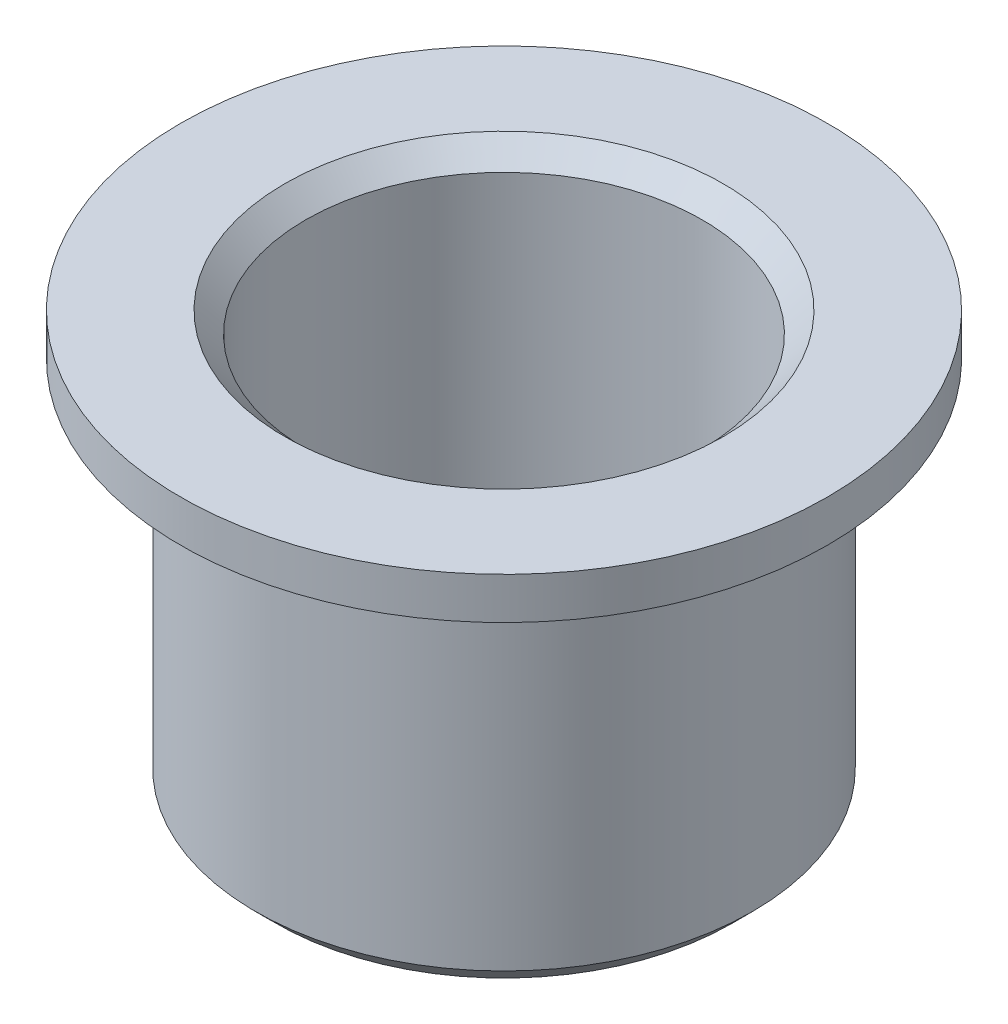
ISO-10303-21;
HEADER;
FILE_DESCRIPTION(('STEP AP214'),'2;1');
FILE_NAME('part.step','',(''),(''),'','','');
FILE_SCHEMA(('AUTOMOTIVE_DESIGN { 1 0 10303 214 1 1 1 1 }'));
ENDSEC;
DATA;
#1=APPLICATION_CONTEXT('core data for automotive mechanical design processes');
#2=APPLICATION_PROTOCOL_DEFINITION('international standard','automotive_design',2000,#1);
#3=PRODUCT_CONTEXT('',#1,'mechanical');
#4=PRODUCT('Part','Part','',(#3));
#5=PRODUCT_RELATED_PRODUCT_CATEGORY('part','',(#4));
#6=PRODUCT_DEFINITION_FORMATION('','',#4);
#7=PRODUCT_DEFINITION_CONTEXT('part definition',#1,'design');
#8=PRODUCT_DEFINITION('design','',#6,#7);
#9=PRODUCT_DEFINITION_SHAPE('','',#8);
#10=(LENGTH_UNIT() NAMED_UNIT(*) SI_UNIT(.MILLI.,.METRE.));
#11=(NAMED_UNIT(*) PLANE_ANGLE_UNIT() SI_UNIT($,.RADIAN.));
#12=(NAMED_UNIT(*) SI_UNIT($,.STERADIAN.) SOLID_ANGLE_UNIT());
#13=UNCERTAINTY_MEASURE_WITH_UNIT(LENGTH_MEASURE(1.E-05),#10,'distance_accuracy_value','');
#14=(GEOMETRIC_REPRESENTATION_CONTEXT(3) GLOBAL_UNCERTAINTY_ASSIGNED_CONTEXT((#13)) GLOBAL_UNIT_ASSIGNED_CONTEXT((#10,
#11,#12)) REPRESENTATION_CONTEXT('',''));
#15=CARTESIAN_POINT('',(0.,0.,0.));
#16=DIRECTION('',(0.,0.,1.));
#17=DIRECTION('',(1.,0.,0.));
#18=AXIS2_PLACEMENT_3D('',#15,#16,#17);
#19=CARTESIAN_POINT('',(0.,-12.923275862069,0.));
#20=DIRECTION('',(0.,-1.,0.));
#21=DIRECTION('',(1.,0.,0.));
#22=AXIS2_PLACEMENT_3D('',#19,#20,#21);
#23=CYLINDRICAL_SURFACE('',#22,5.95000000000001);
#24=CARTESIAN_POINT('',(0.,7.96076951545869,0.));
#25=DIRECTION('',(0.,-1.,0.));
#26=DIRECTION('',(1.,0.,0.));
#27=AXIS2_PLACEMENT_3D('',#24,#25,#26);
#28=CIRCLE('',#27,5.95000000000001);
#29=CARTESIAN_POINT('',(5.95000000000001,7.96076951545869,0.));
#30=VERTEX_POINT('',#29);
#31=EDGE_CURVE('E59',#30,#30,#28,.T.);
#32=ORIENTED_EDGE('',*,*,#31,.T.);
#33=EDGE_LOOP('',(#32));
#34=FACE_BOUND('',#33,.T.);
#35=CARTESIAN_POINT('',(0.,0.499999999999999,0.));
#36=DIRECTION('',(0.,-1.,0.));
#37=DIRECTION('',(1.,0.,0.));
#38=AXIS2_PLACEMENT_3D('',#35,#36,#37);
#39=CIRCLE('',#38,5.95000000000001);
#40=CARTESIAN_POINT('',(5.95,0.5,0.));
#41=VERTEX_POINT('',#40);
#42=EDGE_CURVE('E10',#41,#41,#39,.T.);
#43=ORIENTED_EDGE('',*,*,#42,.F.);
#44=EDGE_LOOP('',(#43));
#45=FACE_BOUND('',#44,.T.);
#46=ADVANCED_FACE('F31',(#34,#45),#23,.T.);
#47=CARTESIAN_POINT('',(0.,0.,0.));
#48=DIRECTION('',(0.,1.,0.));
#49=DIRECTION('',(-1.,0.,0.));
#50=AXIS2_PLACEMENT_3D('',#47,#48,#49);
#51=CONICAL_SURFACE('',#50,5.45000000000001,0.785398163397447);
#52=ORIENTED_EDGE('',*,*,#42,.T.);
#53=EDGE_LOOP('',(#52));
#54=FACE_BOUND('',#53,.T.);
#55=CARTESIAN_POINT('',(0.,0.,0.));
#56=DIRECTION('',(0.,-1.,0.));
#57=DIRECTION('',(1.,0.,0.));
#58=AXIS2_PLACEMENT_3D('',#55,#56,#57);
#59=CIRCLE('',#58,5.45000000000001);
#60=CARTESIAN_POINT('',(5.45,0.,0.));
#61=VERTEX_POINT('',#60);
#62=EDGE_CURVE('E37',#61,#61,#59,.T.);
#63=ORIENTED_EDGE('',*,*,#62,.F.);
#64=EDGE_LOOP('',(#63));
#65=FACE_BOUND('',#64,.T.);
#66=ADVANCED_FACE('F77',(#54,#65),#51,.T.);
#67=CARTESIAN_POINT('',(5.45,0.,0.));
#68=DIRECTION('',(0.,-1.,0.));
#69=DIRECTION('',(1.,0.,0.));
#70=AXIS2_PLACEMENT_3D('',#67,#68,#69);
#71=PLANE('',#70);
#72=ORIENTED_EDGE('',*,*,#62,.T.);
#73=EDGE_LOOP('',(#72));
#74=FACE_BOUND('',#73,.T.);
#75=CARTESIAN_POINT('',(0.,0.,0.));
#76=DIRECTION('',(0.,-1.,0.));
#77=DIRECTION('',(1.,0.,0.));
#78=AXIS2_PLACEMENT_3D('',#75,#76,#77);
#79=CIRCLE('',#78,4.75);
#80=CARTESIAN_POINT('',(4.75,0.,0.));
#81=VERTEX_POINT('',#80);
#82=EDGE_CURVE('E41',#81,#81,#79,.T.);
#83=ORIENTED_EDGE('',*,*,#82,.F.);
#84=EDGE_LOOP('',(#83));
#85=FACE_BOUND('',#84,.T.);
#86=ADVANCED_FACE('F81',(#74,#85),#71,.T.);
#87=CARTESIAN_POINT('',(0.,-12.923275862069,0.));
#88=DIRECTION('',(0.,-1.,0.));
#89=DIRECTION('',(1.,0.,0.));
#90=AXIS2_PLACEMENT_3D('',#87,#88,#89);
#91=CYLINDRICAL_SURFACE('',#90,4.75);
#92=ORIENTED_EDGE('',*,*,#82,.T.);
#93=EDGE_LOOP('',(#92));
#94=FACE_BOUND('',#93,.T.);
#95=CARTESIAN_POINT('',(0.,9.5,0.));
#96=DIRECTION('',(0.,-1.,0.));
#97=DIRECTION('',(1.,0.,0.));
#98=AXIS2_PLACEMENT_3D('',#95,#96,#97);
#99=CIRCLE('',#98,4.75);
#100=CARTESIAN_POINT('',(4.75,9.5,0.));
#101=VERTEX_POINT('',#100);
#102=EDGE_CURVE('E45',#101,#101,#99,.T.);
#103=ORIENTED_EDGE('',*,*,#102,.F.);
#104=EDGE_LOOP('',(#103));
#105=FACE_BOUND('',#104,.T.);
#106=ADVANCED_FACE('F85',(#94,#105),#91,.F.);
#107=CARTESIAN_POINT('',(0.,10.,0.));
#108=DIRECTION('',(0.,1.,0.));
#109=DIRECTION('',(-1.,0.,0.));
#110=AXIS2_PLACEMENT_3D('',#107,#108,#109);
#111=CONICAL_SURFACE('',#110,5.25,0.785398163397447);
#112=ORIENTED_EDGE('',*,*,#102,.T.);
#113=EDGE_LOOP('',(#112));
#114=FACE_BOUND('',#113,.T.);
#115=CARTESIAN_POINT('',(0.,10.,0.));
#116=DIRECTION('',(0.,-1.,0.));
#117=DIRECTION('',(1.,0.,0.));
#118=AXIS2_PLACEMENT_3D('',#115,#116,#117);
#119=CIRCLE('',#118,5.25);
#120=CARTESIAN_POINT('',(5.25,10.,0.));
#121=VERTEX_POINT('',#120);
#122=EDGE_CURVE('E50',#121,#121,#119,.T.);
#123=ORIENTED_EDGE('',*,*,#122,.F.);
#124=EDGE_LOOP('',(#123));
#125=FACE_BOUND('',#124,.T.);
#126=ADVANCED_FACE('F91',(#114,#125),#111,.F.);
#127=CARTESIAN_POINT('',(5.25,10.,0.));
#128=DIRECTION('',(0.,1.,0.));
#129=DIRECTION('',(-1.,0.,0.));
#130=AXIS2_PLACEMENT_3D('',#127,#128,#129);
#131=PLANE('',#130);
#132=ORIENTED_EDGE('',*,*,#122,.T.);
#133=EDGE_LOOP('',(#132));
#134=FACE_BOUND('',#133,.T.);
#135=CARTESIAN_POINT('',(0.,10.,0.));
#136=DIRECTION('',(0.,-1.,0.));
#137=DIRECTION('',(1.,0.,0.));
#138=AXIS2_PLACEMENT_3D('',#135,#136,#137);
#139=CIRCLE('',#138,7.75);
#140=CARTESIAN_POINT('',(7.75,10.,0.));
#141=VERTEX_POINT('',#140);
#142=EDGE_CURVE('E53',#141,#141,#139,.T.);
#143=ORIENTED_EDGE('',*,*,#142,.F.);
#144=EDGE_LOOP('',(#143));
#145=FACE_BOUND('',#144,.T.);
#146=ADVANCED_FACE('F73',(#134,#145),#131,.T.);
#147=CARTESIAN_POINT('',(0.,-12.923275862069,0.));
#148=DIRECTION('',(0.,-1.,0.));
#149=DIRECTION('',(1.,0.,0.));
#150=AXIS2_PLACEMENT_3D('',#147,#148,#149);
#151=CYLINDRICAL_SURFACE('',#150,7.75);
#152=ORIENTED_EDGE('',*,*,#142,.T.);
#153=EDGE_LOOP('',(#152));
#154=FACE_BOUND('',#153,.T.);
#155=CARTESIAN_POINT('',(0.,9.,0.));
#156=DIRECTION('',(0.,-1.,0.));
#157=DIRECTION('',(1.,0.,0.));
#158=AXIS2_PLACEMENT_3D('',#155,#156,#157);
#159=CIRCLE('',#158,7.75);
#160=CARTESIAN_POINT('',(7.75,9.,0.));
#161=VERTEX_POINT('',#160);
#162=EDGE_CURVE('E56',#161,#161,#159,.T.);
#163=ORIENTED_EDGE('',*,*,#162,.F.);
#164=EDGE_LOOP('',(#163));
#165=FACE_BOUND('',#164,.T.);
#166=ADVANCED_FACE('F67',(#154,#165),#151,.T.);
#167=CARTESIAN_POINT('',(0.,7.96076951545869,0.));
#168=DIRECTION('',(0.,1.,0.));
#169=DIRECTION('',(-1.,0.,0.));
#170=AXIS2_PLACEMENT_3D('',#167,#168,#169);
#171=CONICAL_SURFACE('',#170,5.95000000000001,1.0471975511966);
#172=ORIENTED_EDGE('',*,*,#162,.T.);
#173=EDGE_LOOP('',(#172));
#174=FACE_BOUND('',#173,.T.);
#175=ORIENTED_EDGE('',*,*,#31,.F.);
#176=EDGE_LOOP('',(#175));
#177=FACE_BOUND('',#176,.T.);
#178=ADVANCED_FACE('F65',(#174,#177),#171,.T.);
#179=CLOSED_SHELL('',(#46,#66,#86,#106,#126,#146,#166,#178));
#180=MANIFOLD_SOLID_BREP('B2',#179);
#181=ADVANCED_BREP_SHAPE_REPRESENTATION('',(#18,#180),#14);
#182=SHAPE_DEFINITION_REPRESENTATION(#9,#181);
ENDSEC;
END-ISO-10303-21;
